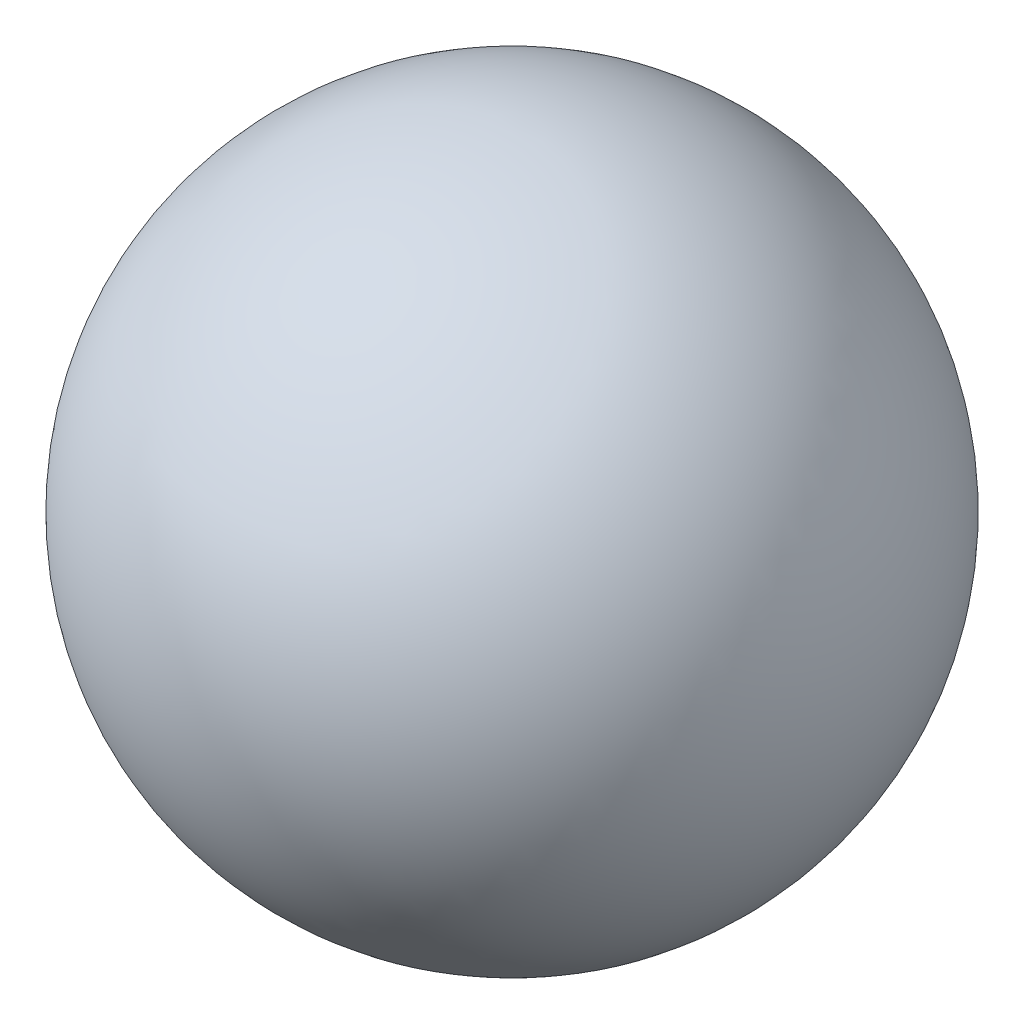
ISO-10303-21;
HEADER;
FILE_DESCRIPTION(('STEP AP214'),'2;1');
FILE_NAME('part.step','',(''),(''),'','','');
FILE_SCHEMA(('AUTOMOTIVE_DESIGN { 1 0 10303 214 1 1 1 1 }'));
ENDSEC;
DATA;
#1=APPLICATION_CONTEXT('core data for automotive mechanical design processes');
#2=APPLICATION_PROTOCOL_DEFINITION('international standard','automotive_design',2000,#1);
#3=PRODUCT_CONTEXT('',#1,'mechanical');
#4=PRODUCT('Part','Part','',(#3));
#5=PRODUCT_RELATED_PRODUCT_CATEGORY('part','',(#4));
#6=PRODUCT_DEFINITION_FORMATION('','',#4);
#7=PRODUCT_DEFINITION_CONTEXT('part definition',#1,'design');
#8=PRODUCT_DEFINITION('design','',#6,#7);
#9=PRODUCT_DEFINITION_SHAPE('','',#8);
#10=(LENGTH_UNIT() NAMED_UNIT(*) SI_UNIT(.MILLI.,.METRE.));
#11=(NAMED_UNIT(*) PLANE_ANGLE_UNIT() SI_UNIT($,.RADIAN.));
#12=(NAMED_UNIT(*) SI_UNIT($,.STERADIAN.) SOLID_ANGLE_UNIT());
#13=UNCERTAINTY_MEASURE_WITH_UNIT(LENGTH_MEASURE(1.E-05),#10,'distance_accuracy_value','');
#14=(GEOMETRIC_REPRESENTATION_CONTEXT(3) GLOBAL_UNCERTAINTY_ASSIGNED_CONTEXT((#13)) GLOBAL_UNIT_ASSIGNED_CONTEXT((#10,
#11,#12)) REPRESENTATION_CONTEXT('',''));
#15=CARTESIAN_POINT('',(0.,0.,0.));
#16=DIRECTION('',(0.,0.,1.));
#17=DIRECTION('',(1.,0.,0.));
#18=AXIS2_PLACEMENT_3D('',#15,#16,#17);
#19=CARTESIAN_POINT('',(0.,0.,0.));
#20=DIRECTION('',(0.,1.,0.));
#21=DIRECTION('',(1.,0.,0.));
#22=AXIS2_PLACEMENT_3D('',#19,#20,#21);
#23=SPHERICAL_SURFACE('',#22,1.25);
#24=CARTESIAN_POINT('',(0.,1.25,0.));
#25=VERTEX_POINT('',#24);
#26=VERTEX_LOOP('',#25);
#27=FACE_BOUND('',#26,.T.);
#28=ADVANCED_FACE('F35',(#27),#23,.T.);
#29=CLOSED_SHELL('',(#28));
#30=MANIFOLD_SOLID_BREP('B2',#29);
#31=ADVANCED_BREP_SHAPE_REPRESENTATION('',(#18,#30),#14);
#32=SHAPE_DEFINITION_REPRESENTATION(#9,#31);
ENDSEC;
END-ISO-10303-21;
